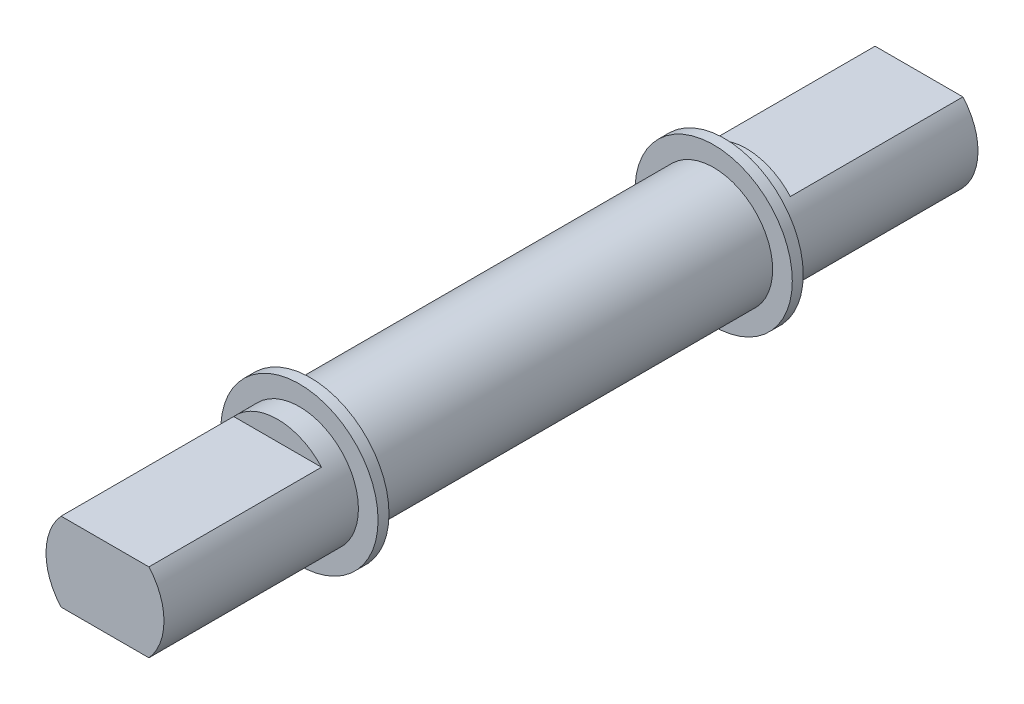
ISO-10303-21;
HEADER;
FILE_DESCRIPTION(('STEP AP214'),'2;1');
FILE_NAME('part.step','',(''),(''),'','','');
FILE_SCHEMA(('AUTOMOTIVE_DESIGN { 1 0 10303 214 1 1 1 1 }'));
ENDSEC;
DATA;
#1=APPLICATION_CONTEXT('core data for automotive mechanical design processes');
#2=APPLICATION_PROTOCOL_DEFINITION('international standard','automotive_design',2000,#1);
#3=PRODUCT_CONTEXT('',#1,'mechanical');
#4=PRODUCT('Part','Part','',(#3));
#5=PRODUCT_RELATED_PRODUCT_CATEGORY('part','',(#4));
#6=PRODUCT_DEFINITION_FORMATION('','',#4);
#7=PRODUCT_DEFINITION_CONTEXT('part definition',#1,'design');
#8=PRODUCT_DEFINITION('design','',#6,#7);
#9=PRODUCT_DEFINITION_SHAPE('','',#8);
#10=(LENGTH_UNIT() NAMED_UNIT(*) SI_UNIT(.MILLI.,.METRE.));
#11=(NAMED_UNIT(*) PLANE_ANGLE_UNIT() SI_UNIT($,.RADIAN.));
#12=(NAMED_UNIT(*) SI_UNIT($,.STERADIAN.) SOLID_ANGLE_UNIT());
#13=UNCERTAINTY_MEASURE_WITH_UNIT(LENGTH_MEASURE(1.E-05),#10,'distance_accuracy_value','');
#14=(GEOMETRIC_REPRESENTATION_CONTEXT(3) GLOBAL_UNCERTAINTY_ASSIGNED_CONTEXT((#13)) GLOBAL_UNIT_ASSIGNED_CONTEXT((#10,
#11,#12)) REPRESENTATION_CONTEXT('',''));
#15=CARTESIAN_POINT('',(0.,0.,0.));
#16=DIRECTION('',(0.,0.,1.));
#17=DIRECTION('',(1.,0.,0.));
#18=AXIS2_PLACEMENT_3D('',#15,#16,#17);
#19=CARTESIAN_POINT('',(0.,0.,-10.73));
#20=DIRECTION('',(0.,0.,-1.));
#21=DIRECTION('',(1.,0.,0.));
#22=AXIS2_PLACEMENT_3D('',#19,#20,#21);
#23=PLANE('',#22);
#24=CARTESIAN_POINT('',(0.,0.,-10.73));
#25=DIRECTION('',(0.,0.,1.));
#26=DIRECTION('',(1.,0.,0.));
#27=AXIS2_PLACEMENT_3D('',#24,#25,#26);
#28=CIRCLE('',#27,2.7);
#29=CARTESIAN_POINT('',(2.01,1.80274790250884,-10.73));
#30=VERTEX_POINT('',#29);
#31=CARTESIAN_POINT('',(-2.01,1.80274790250884,-10.73));
#32=VERTEX_POINT('',#31);
#33=EDGE_CURVE('E116',#30,#32,#28,.T.);
#34=ORIENTED_EDGE('',*,*,#33,.F.);
#35=DIRECTION('',(-1.,0.,0.));
#36=VECTOR('',#35,1.);
#37=CARTESIAN_POINT('',(0.,1.80274790250884,-10.73));
#38=LINE('',#37,#36);
#39=EDGE_CURVE('E11',#30,#32,#38,.T.);
#40=ORIENTED_EDGE('',*,*,#39,.T.);
#41=EDGE_LOOP('',(#34,#40));
#42=FACE_BOUND('',#41,.T.);
#43=ADVANCED_FACE('F45',(#42),#23,.T.);
#44=CARTESIAN_POINT('',(0.,0.,10.73));
#45=DIRECTION('',(0.,0.,1.));
#46=DIRECTION('',(1.,0.,0.));
#47=AXIS2_PLACEMENT_3D('',#44,#45,#46);
#48=PLANE('',#47);
#49=CARTESIAN_POINT('',(0.,0.,10.73));
#50=DIRECTION('',(0.,0.,1.));
#51=DIRECTION('',(1.,0.,0.));
#52=AXIS2_PLACEMENT_3D('',#49,#50,#51);
#53=CIRCLE('',#52,2.7);
#54=CARTESIAN_POINT('',(-2.01,-1.80274790250884,10.73));
#55=VERTEX_POINT('',#54);
#56=CARTESIAN_POINT('',(2.01,-1.80274790250884,10.73));
#57=VERTEX_POINT('',#56);
#58=EDGE_CURVE('E174',#55,#57,#53,.T.);
#59=ORIENTED_EDGE('',*,*,#58,.T.);
#60=DIRECTION('',(-1.,0.,0.));
#61=VECTOR('',#60,1.);
#62=CARTESIAN_POINT('',(0.,-1.80274790250884,10.73));
#63=LINE('',#62,#61);
#64=EDGE_CURVE('E194',#57,#55,#63,.T.);
#65=ORIENTED_EDGE('',*,*,#64,.T.);
#66=EDGE_LOOP('',(#59,#65));
#67=FACE_BOUND('',#66,.T.);
#68=ADVANCED_FACE('F207',(#67),#48,.T.);
#69=CARTESIAN_POINT('',(0.,0.,9.23));
#70=DIRECTION('',(0.,0.,-1.));
#71=DIRECTION('',(-1.,0.,0.));
#72=AXIS2_PLACEMENT_3D('',#69,#70,#71);
#73=CYLINDRICAL_SURFACE('',#72,2.7);
#74=CARTESIAN_POINT('',(0.,0.,9.23));
#75=DIRECTION('',(0.,0.,1.));
#76=DIRECTION('',(1.,0.,0.));
#77=AXIS2_PLACEMENT_3D('',#74,#75,#76);
#78=CIRCLE('',#77,2.7);
#79=CARTESIAN_POINT('',(2.7,0.,9.23));
#80=VERTEX_POINT('',#79);
#81=EDGE_CURVE('E182',#80,#80,#78,.T.);
#82=ORIENTED_EDGE('',*,*,#81,.F.);
#83=EDGE_LOOP('',(#82));
#84=FACE_BOUND('',#83,.T.);
#85=CARTESIAN_POINT('',(0.,0.,-9.23));
#86=DIRECTION('',(0.,0.,1.));
#87=DIRECTION('',(1.,0.,0.));
#88=AXIS2_PLACEMENT_3D('',#85,#86,#87);
#89=CIRCLE('',#88,2.7);
#90=CARTESIAN_POINT('',(2.7,0.,-9.23));
#91=VERTEX_POINT('',#90);
#92=EDGE_CURVE('E150',#91,#91,#89,.T.);
#93=ORIENTED_EDGE('',*,*,#92,.T.);
#94=EDGE_LOOP('',(#93));
#95=FACE_BOUND('',#94,.T.);
#96=ADVANCED_FACE('F47',(#84,#95),#73,.T.);
#97=CARTESIAN_POINT('',(0.,0.,9.73));
#98=DIRECTION('',(0.,0.,-1.));
#99=DIRECTION('',(-1.,0.,0.));
#100=AXIS2_PLACEMENT_3D('',#97,#98,#99);
#101=CYLINDRICAL_SURFACE('',#100,3.6);
#102=CARTESIAN_POINT('',(0.,0.,9.73));
#103=DIRECTION('',(0.,0.,1.));
#104=DIRECTION('',(1.,0.,0.));
#105=AXIS2_PLACEMENT_3D('',#102,#103,#104);
#106=CIRCLE('',#105,3.6);
#107=CARTESIAN_POINT('',(3.6,0.,9.73));
#108=VERTEX_POINT('',#107);
#109=EDGE_CURVE('E183',#108,#108,#106,.T.);
#110=ORIENTED_EDGE('',*,*,#109,.F.);
#111=EDGE_LOOP('',(#110));
#112=FACE_BOUND('',#111,.T.);
#113=CARTESIAN_POINT('',(0.,0.,9.23));
#114=DIRECTION('',(0.,0.,1.));
#115=DIRECTION('',(1.,0.,0.));
#116=AXIS2_PLACEMENT_3D('',#113,#114,#115);
#117=CIRCLE('',#116,3.6);
#118=CARTESIAN_POINT('',(3.6,0.,9.23));
#119=VERTEX_POINT('',#118);
#120=EDGE_CURVE('E177',#119,#119,#117,.T.);
#121=ORIENTED_EDGE('',*,*,#120,.T.);
#122=EDGE_LOOP('',(#121));
#123=FACE_BOUND('',#122,.T.);
#124=ADVANCED_FACE('F217',(#112,#123),#101,.T.);
#125=CARTESIAN_POINT('',(0.,0.,9.73));
#126=DIRECTION('',(0.,0.,1.));
#127=DIRECTION('',(1.,0.,0.));
#128=AXIS2_PLACEMENT_3D('',#125,#126,#127);
#129=PLANE('',#128);
#130=CARTESIAN_POINT('',(0.,0.,9.73));
#131=DIRECTION('',(0.,0.,1.));
#132=DIRECTION('',(1.,0.,0.));
#133=AXIS2_PLACEMENT_3D('',#130,#131,#132);
#134=CIRCLE('',#133,2.7);
#135=CARTESIAN_POINT('',(2.7,0.,9.73));
#136=VERTEX_POINT('',#135);
#137=EDGE_CURVE('E178',#136,#136,#134,.T.);
#138=ORIENTED_EDGE('',*,*,#137,.F.);
#139=EDGE_LOOP('',(#138));
#140=FACE_BOUND('',#139,.T.);
#141=ORIENTED_EDGE('',*,*,#109,.T.);
#142=EDGE_LOOP('',(#141));
#143=FACE_BOUND('',#142,.T.);
#144=ADVANCED_FACE('F364',(#140,#143),#129,.T.);
#145=CARTESIAN_POINT('',(0.,0.,9.23));
#146=DIRECTION('',(0.,0.,1.));
#147=DIRECTION('',(1.,0.,0.));
#148=AXIS2_PLACEMENT_3D('',#145,#146,#147);
#149=PLANE('',#148);
#150=ORIENTED_EDGE('',*,*,#81,.T.);
#151=EDGE_LOOP('',(#150));
#152=FACE_BOUND('',#151,.T.);
#153=ORIENTED_EDGE('',*,*,#120,.F.);
#154=EDGE_LOOP('',(#153));
#155=FACE_BOUND('',#154,.T.);
#156=ADVANCED_FACE('F231',(#152,#155),#149,.F.);
#157=CARTESIAN_POINT('',(0.,0.,10.73));
#158=DIRECTION('',(0.,0.,-1.));
#159=DIRECTION('',(-1.,0.,0.));
#160=AXIS2_PLACEMENT_3D('',#157,#158,#159);
#161=CYLINDRICAL_SURFACE('',#160,2.7);
#162=ORIENTED_EDGE('',*,*,#137,.T.);
#163=EDGE_LOOP('',(#162));
#164=FACE_BOUND('',#163,.T.);
#165=CARTESIAN_POINT('',(2.01,1.80274790250884,10.73));
#166=VERTEX_POINT('',#165);
#167=CARTESIAN_POINT('',(-2.01,1.80274790250884,10.73));
#168=VERTEX_POINT('',#167);
#169=EDGE_CURVE('E175',#166,#168,#53,.T.);
#170=ORIENTED_EDGE('',*,*,#169,.F.);
#171=DIRECTION('',(0.,0.,-1.));
#172=VECTOR('',#171,1.);
#173=CARTESIAN_POINT('',(2.01,1.80274790250884,18.63));
#174=LINE('',#173,#172);
#175=CARTESIAN_POINT('',(2.01,1.80274790250884,18.63));
#176=VERTEX_POINT('',#175);
#177=EDGE_CURVE('E165',#176,#166,#174,.T.);
#178=ORIENTED_EDGE('',*,*,#177,.F.);
#179=CARTESIAN_POINT('',(0.,0.,18.63));
#180=DIRECTION('',(0.,0.,1.));
#181=DIRECTION('',(1.,0.,0.));
#182=AXIS2_PLACEMENT_3D('',#179,#180,#181);
#183=CIRCLE('',#182,2.7);
#184=CARTESIAN_POINT('',(2.01,-1.80274790250884,18.63));
#185=VERTEX_POINT('',#184);
#186=EDGE_CURVE('E157',#185,#176,#183,.T.);
#187=ORIENTED_EDGE('',*,*,#186,.F.);
#188=DIRECTION('',(0.,0.,-1.));
#189=VECTOR('',#188,1.);
#190=CARTESIAN_POINT('',(2.01,-1.80274790250884,18.63));
#191=LINE('',#190,#189);
#192=EDGE_CURVE('E168',#185,#57,#191,.T.);
#193=ORIENTED_EDGE('',*,*,#192,.T.);
#194=ORIENTED_EDGE('',*,*,#58,.F.);
#195=DIRECTION('',(0.,0.,-1.));
#196=VECTOR('',#195,1.);
#197=CARTESIAN_POINT('',(-2.01,-1.80274790250884,18.63));
#198=LINE('',#197,#196);
#199=CARTESIAN_POINT('',(-2.01,-1.80274790250884,18.63));
#200=VERTEX_POINT('',#199);
#201=EDGE_CURVE('E171',#200,#55,#198,.T.);
#202=ORIENTED_EDGE('',*,*,#201,.F.);
#203=CARTESIAN_POINT('',(-2.01,1.80274790250884,18.63));
#204=VERTEX_POINT('',#203);
#205=EDGE_CURVE('E153',#204,#200,#183,.T.);
#206=ORIENTED_EDGE('',*,*,#205,.F.);
#207=DIRECTION('',(0.,0.,-1.));
#208=VECTOR('',#207,1.);
#209=CARTESIAN_POINT('',(-2.01,1.80274790250884,18.63));
#210=LINE('',#209,#208);
#211=EDGE_CURVE('E162',#204,#168,#210,.T.);
#212=ORIENTED_EDGE('',*,*,#211,.T.);
#213=EDGE_LOOP('',(#170,#178,#187,#193,#194,#202,#206,#212));
#214=FACE_BOUND('',#213,.T.);
#215=ADVANCED_FACE('F223',(#164,#214),#161,.T.);
#216=DIRECTION('',(-1.,0.,0.));
#217=VECTOR('',#216,1.);
#218=CARTESIAN_POINT('',(0.,1.80274790250884,10.73));
#219=LINE('',#218,#217);
#220=EDGE_CURVE('E181',#166,#168,#219,.T.);
#221=ORIENTED_EDGE('',*,*,#220,.F.);
#222=ORIENTED_EDGE('',*,*,#169,.T.);
#223=EDGE_LOOP('',(#221,#222));
#224=FACE_BOUND('',#223,.T.);
#225=ADVANCED_FACE('F213',(#224),#48,.T.);
#226=CARTESIAN_POINT('',(0.,-1.80274790250884,18.63));
#227=DIRECTION('',(0.,1.,0.));
#228=DIRECTION('',(0.,0.,1.));
#229=AXIS2_PLACEMENT_3D('',#226,#227,#228);
#230=PLANE('',#229);
#231=ORIENTED_EDGE('',*,*,#64,.F.);
#232=ORIENTED_EDGE('',*,*,#192,.F.);
#233=DIRECTION('',(1.,0.,0.));
#234=VECTOR('',#233,1.);
#235=CARTESIAN_POINT('',(0.,-1.80274790250884,18.63));
#236=LINE('',#235,#234);
#237=EDGE_CURVE('E156',#200,#185,#236,.T.);
#238=ORIENTED_EDGE('',*,*,#237,.F.);
#239=ORIENTED_EDGE('',*,*,#201,.T.);
#240=EDGE_LOOP('',(#231,#232,#238,#239));
#241=FACE_BOUND('',#240,.T.);
#242=ADVANCED_FACE('F222',(#241),#230,.F.);
#243=CARTESIAN_POINT('',(0.,1.80274790250884,18.63));
#244=DIRECTION('',(0.,1.,0.));
#245=DIRECTION('',(0.,0.,1.));
#246=AXIS2_PLACEMENT_3D('',#243,#244,#245);
#247=PLANE('',#246);
#248=ORIENTED_EDGE('',*,*,#177,.T.);
#249=ORIENTED_EDGE('',*,*,#220,.T.);
#250=ORIENTED_EDGE('',*,*,#211,.F.);
#251=DIRECTION('',(1.,0.,0.));
#252=VECTOR('',#251,1.);
#253=CARTESIAN_POINT('',(0.,1.80274790250884,18.63));
#254=LINE('',#253,#252);
#255=EDGE_CURVE('E159',#204,#176,#254,.T.);
#256=ORIENTED_EDGE('',*,*,#255,.T.);
#257=EDGE_LOOP('',(#248,#249,#250,#256));
#258=FACE_BOUND('',#257,.T.);
#259=ADVANCED_FACE('F229',(#258),#247,.T.);
#260=CARTESIAN_POINT('',(0.,0.,18.63));
#261=DIRECTION('',(0.,0.,1.));
#262=DIRECTION('',(1.,0.,0.));
#263=AXIS2_PLACEMENT_3D('',#260,#261,#262);
#264=PLANE('',#263);
#265=ORIENTED_EDGE('',*,*,#205,.T.);
#266=ORIENTED_EDGE('',*,*,#237,.T.);
#267=ORIENTED_EDGE('',*,*,#186,.T.);
#268=ORIENTED_EDGE('',*,*,#255,.F.);
#269=EDGE_LOOP('',(#265,#266,#267,#268));
#270=FACE_BOUND('',#269,.T.);
#271=ADVANCED_FACE('F241',(#270),#264,.T.);
#272=CARTESIAN_POINT('',(0.,0.,-9.73));
#273=DIRECTION('',(0.,0.,1.));
#274=DIRECTION('',(1.,0.,0.));
#275=AXIS2_PLACEMENT_3D('',#272,#273,#274);
#276=CYLINDRICAL_SURFACE('',#275,3.6);
#277=CARTESIAN_POINT('',(0.,0.,-9.73));
#278=DIRECTION('',(0.,0.,1.));
#279=DIRECTION('',(1.,0.,0.));
#280=AXIS2_PLACEMENT_3D('',#277,#278,#279);
#281=CIRCLE('',#280,3.6);
#282=CARTESIAN_POINT('',(3.6,0.,-9.73));
#283=VERTEX_POINT('',#282);
#284=EDGE_CURVE('E147',#283,#283,#281,.T.);
#285=ORIENTED_EDGE('',*,*,#284,.T.);
#286=EDGE_LOOP('',(#285));
#287=FACE_BOUND('',#286,.T.);
#288=CARTESIAN_POINT('',(0.,0.,-9.23));
#289=DIRECTION('',(0.,0.,1.));
#290=DIRECTION('',(1.,0.,0.));
#291=AXIS2_PLACEMENT_3D('',#288,#289,#290);
#292=CIRCLE('',#291,3.6);
#293=CARTESIAN_POINT('',(3.6,0.,-9.23));
#294=VERTEX_POINT('',#293);
#295=EDGE_CURVE('E143',#294,#294,#292,.T.);
#296=ORIENTED_EDGE('',*,*,#295,.F.);
#297=EDGE_LOOP('',(#296));
#298=FACE_BOUND('',#297,.T.);
#299=ADVANCED_FACE('F247',(#287,#298),#276,.T.);
#300=CARTESIAN_POINT('',(0.,0.,-9.73));
#301=DIRECTION('',(0.,0.,-1.));
#302=DIRECTION('',(1.,0.,0.));
#303=AXIS2_PLACEMENT_3D('',#300,#301,#302);
#304=PLANE('',#303);
#305=CARTESIAN_POINT('',(0.,0.,-9.73));
#306=DIRECTION('',(0.,0.,1.));
#307=DIRECTION('',(1.,0.,0.));
#308=AXIS2_PLACEMENT_3D('',#305,#306,#307);
#309=CIRCLE('',#308,2.7);
#310=CARTESIAN_POINT('',(2.7,0.,-9.73));
#311=VERTEX_POINT('',#310);
#312=EDGE_CURVE('E118',#311,#311,#309,.T.);
#313=ORIENTED_EDGE('',*,*,#312,.T.);
#314=EDGE_LOOP('',(#313));
#315=FACE_BOUND('',#314,.T.);
#316=ORIENTED_EDGE('',*,*,#284,.F.);
#317=EDGE_LOOP('',(#316));
#318=FACE_BOUND('',#317,.T.);
#319=ADVANCED_FACE('F253',(#315,#318),#304,.T.);
#320=CARTESIAN_POINT('',(0.,0.,-9.23));
#321=DIRECTION('',(0.,0.,-1.));
#322=DIRECTION('',(1.,0.,0.));
#323=AXIS2_PLACEMENT_3D('',#320,#321,#322);
#324=PLANE('',#323);
#325=ORIENTED_EDGE('',*,*,#92,.F.);
#326=EDGE_LOOP('',(#325));
#327=FACE_BOUND('',#326,.T.);
#328=ORIENTED_EDGE('',*,*,#295,.T.);
#329=EDGE_LOOP('',(#328));
#330=FACE_BOUND('',#329,.T.);
#331=ADVANCED_FACE('F204',(#327,#330),#324,.F.);
#332=CARTESIAN_POINT('',(0.,0.,-10.73));
#333=DIRECTION('',(0.,0.,1.));
#334=DIRECTION('',(1.,0.,0.));
#335=AXIS2_PLACEMENT_3D('',#332,#333,#334);
#336=CYLINDRICAL_SURFACE('',#335,2.7);
#337=DIRECTION('',(0.,0.,1.));
#338=VECTOR('',#337,1.);
#339=CARTESIAN_POINT('',(2.01,1.80274790250884,-18.63));
#340=LINE('',#339,#338);
#341=CARTESIAN_POINT('',(2.01,1.80274790250884,-18.63));
#342=VERTEX_POINT('',#341);
#343=EDGE_CURVE('E119',#342,#30,#340,.T.);
#344=ORIENTED_EDGE('',*,*,#343,.T.);
#345=ORIENTED_EDGE('',*,*,#33,.T.);
#346=DIRECTION('',(0.,0.,1.));
#347=VECTOR('',#346,1.);
#348=CARTESIAN_POINT('',(-2.01,1.80274790250884,-18.63));
#349=LINE('',#348,#347);
#350=CARTESIAN_POINT('',(-2.01,1.80274790250884,-18.63));
#351=VERTEX_POINT('',#350);
#352=EDGE_CURVE('E107',#351,#32,#349,.T.);
#353=ORIENTED_EDGE('',*,*,#352,.F.);
#354=CARTESIAN_POINT('',(0.,0.,-18.63));
#355=DIRECTION('',(0.,0.,1.));
#356=DIRECTION('',(1.,0.,0.));
#357=AXIS2_PLACEMENT_3D('',#354,#355,#356);
#358=CIRCLE('',#357,2.7);
#359=CARTESIAN_POINT('',(-2.01,-1.80274790250884,-18.63));
#360=VERTEX_POINT('',#359);
#361=EDGE_CURVE('E114',#351,#360,#358,.T.);
#362=ORIENTED_EDGE('',*,*,#361,.T.);
#363=DIRECTION('',(0.,0.,1.));
#364=VECTOR('',#363,1.);
#365=CARTESIAN_POINT('',(-2.01,-1.80274790250884,-18.63));
#366=LINE('',#365,#364);
#367=CARTESIAN_POINT('',(-2.01,-1.80274790250884,-10.73));
#368=VERTEX_POINT('',#367);
#369=EDGE_CURVE('E133',#360,#368,#366,.T.);
#370=ORIENTED_EDGE('',*,*,#369,.T.);
#371=CARTESIAN_POINT('',(2.01,-1.80274790250884,-10.73));
#372=VERTEX_POINT('',#371);
#373=EDGE_CURVE('E144',#368,#372,#28,.T.);
#374=ORIENTED_EDGE('',*,*,#373,.T.);
#375=DIRECTION('',(0.,0.,1.));
#376=VECTOR('',#375,1.);
#377=CARTESIAN_POINT('',(2.01,-1.80274790250884,-18.63));
#378=LINE('',#377,#376);
#379=CARTESIAN_POINT('',(2.01,-1.80274790250884,-18.63));
#380=VERTEX_POINT('',#379);
#381=EDGE_CURVE('E137',#380,#372,#378,.T.);
#382=ORIENTED_EDGE('',*,*,#381,.F.);
#383=EDGE_CURVE('E127',#380,#342,#358,.T.);
#384=ORIENTED_EDGE('',*,*,#383,.T.);
#385=EDGE_LOOP('',(#344,#345,#353,#362,#370,#374,#382,#384));
#386=FACE_BOUND('',#385,.T.);
#387=ORIENTED_EDGE('',*,*,#312,.F.);
#388=EDGE_LOOP('',(#387));
#389=FACE_BOUND('',#388,.T.);
#390=ADVANCED_FACE('F110',(#386,#389),#336,.T.);
#391=DIRECTION('',(-1.,0.,0.));
#392=VECTOR('',#391,1.);
#393=CARTESIAN_POINT('',(0.,-1.80274790250884,-10.73));
#394=LINE('',#393,#392);
#395=EDGE_CURVE('E53',#372,#368,#394,.T.);
#396=ORIENTED_EDGE('',*,*,#395,.F.);
#397=ORIENTED_EDGE('',*,*,#373,.F.);
#398=EDGE_LOOP('',(#396,#397));
#399=FACE_BOUND('',#398,.T.);
#400=ADVANCED_FACE('F196',(#399),#23,.T.);
#401=CARTESIAN_POINT('',(0.,1.80274790250884,-18.63));
#402=DIRECTION('',(0.,-1.,0.));
#403=DIRECTION('',(0.,0.,-1.));
#404=AXIS2_PLACEMENT_3D('',#401,#402,#403);
#405=PLANE('',#404);
#406=ORIENTED_EDGE('',*,*,#39,.F.);
#407=ORIENTED_EDGE('',*,*,#343,.F.);
#408=DIRECTION('',(1.,0.,0.));
#409=VECTOR('',#408,1.);
#410=CARTESIAN_POINT('',(0.,1.80274790250884,-18.63));
#411=LINE('',#410,#409);
#412=EDGE_CURVE('E122',#351,#342,#411,.T.);
#413=ORIENTED_EDGE('',*,*,#412,.F.);
#414=ORIENTED_EDGE('',*,*,#352,.T.);
#415=EDGE_LOOP('',(#406,#407,#413,#414));
#416=FACE_BOUND('',#415,.T.);
#417=ADVANCED_FACE('F123',(#416),#405,.F.);
#418=CARTESIAN_POINT('',(0.,-1.80274790250884,-18.63));
#419=DIRECTION('',(0.,-1.,0.));
#420=DIRECTION('',(0.,0.,-1.));
#421=AXIS2_PLACEMENT_3D('',#418,#419,#420);
#422=PLANE('',#421);
#423=ORIENTED_EDGE('',*,*,#381,.T.);
#424=ORIENTED_EDGE('',*,*,#395,.T.);
#425=ORIENTED_EDGE('',*,*,#369,.F.);
#426=DIRECTION('',(1.,0.,0.));
#427=VECTOR('',#426,1.);
#428=CARTESIAN_POINT('',(0.,-1.80274790250884,-18.63));
#429=LINE('',#428,#427);
#430=EDGE_CURVE('E131',#360,#380,#429,.T.);
#431=ORIENTED_EDGE('',*,*,#430,.T.);
#432=EDGE_LOOP('',(#423,#424,#425,#431));
#433=FACE_BOUND('',#432,.T.);
#434=ADVANCED_FACE('F195',(#433),#422,.T.);
#435=CARTESIAN_POINT('',(0.,0.,-18.63));
#436=DIRECTION('',(0.,0.,-1.));
#437=DIRECTION('',(1.,0.,0.));
#438=AXIS2_PLACEMENT_3D('',#435,#436,#437);
#439=PLANE('',#438);
#440=ORIENTED_EDGE('',*,*,#361,.F.);
#441=ORIENTED_EDGE('',*,*,#412,.T.);
#442=ORIENTED_EDGE('',*,*,#383,.F.);
#443=ORIENTED_EDGE('',*,*,#430,.F.);
#444=EDGE_LOOP('',(#440,#441,#442,#443));
#445=FACE_BOUND('',#444,.T.);
#446=ADVANCED_FACE('F129',(#445),#439,.T.);
#447=CLOSED_SHELL('',(#43,#68,#96,#124,#144,#156,#215,#225,#242,#259,#271,#299,#319,#331,#390,
#400,#417,#434,#446));
#448=MANIFOLD_SOLID_BREP('B2',#447);
#449=ADVANCED_BREP_SHAPE_REPRESENTATION('',(#18,#448),#14);
#450=SHAPE_DEFINITION_REPRESENTATION(#9,#449);
ENDSEC;
END-ISO-10303-21;
